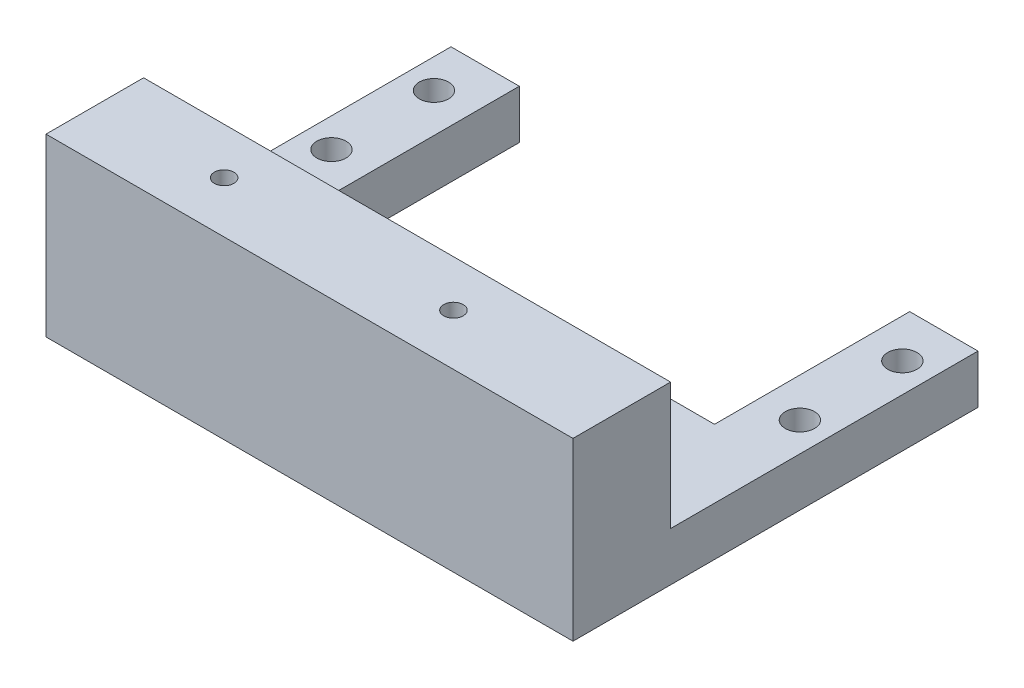
ISO-10303-21;
HEADER;
FILE_DESCRIPTION(('STEP AP214'),'2;1');
FILE_NAME('part.step','',(''),(''),'','','');
FILE_SCHEMA(('AUTOMOTIVE_DESIGN { 1 0 10303 214 1 1 1 1 }'));
ENDSEC;
DATA;
#1=APPLICATION_CONTEXT('core data for automotive mechanical design processes');
#2=APPLICATION_PROTOCOL_DEFINITION('international standard','automotive_design',2000,#1);
#3=PRODUCT_CONTEXT('',#1,'mechanical');
#4=PRODUCT('Part','Part','',(#3));
#5=PRODUCT_RELATED_PRODUCT_CATEGORY('part','',(#4));
#6=PRODUCT_DEFINITION_FORMATION('','',#4);
#7=PRODUCT_DEFINITION_CONTEXT('part definition',#1,'design');
#8=PRODUCT_DEFINITION('design','',#6,#7);
#9=PRODUCT_DEFINITION_SHAPE('','',#8);
#10=(LENGTH_UNIT() NAMED_UNIT(*) SI_UNIT(.MILLI.,.METRE.));
#11=(NAMED_UNIT(*) PLANE_ANGLE_UNIT() SI_UNIT($,.RADIAN.));
#12=(NAMED_UNIT(*) SI_UNIT($,.STERADIAN.) SOLID_ANGLE_UNIT());
#13=UNCERTAINTY_MEASURE_WITH_UNIT(LENGTH_MEASURE(1.E-05),#10,'distance_accuracy_value','');
#14=(GEOMETRIC_REPRESENTATION_CONTEXT(3) GLOBAL_UNCERTAINTY_ASSIGNED_CONTEXT((#13)) GLOBAL_UNIT_ASSIGNED_CONTEXT((#10,
#11,#12)) REPRESENTATION_CONTEXT('',''));
#15=CARTESIAN_POINT('',(0.,0.,0.));
#16=DIRECTION('',(0.,0.,1.));
#17=DIRECTION('',(1.,0.,0.));
#18=AXIS2_PLACEMENT_3D('',#15,#16,#17);
#19=CARTESIAN_POINT('',(-20.,5.,0.));
#20=DIRECTION('',(1.,0.,0.));
#21=DIRECTION('',(0.,0.,-1.));
#22=AXIS2_PLACEMENT_3D('',#19,#20,#21);
#23=PLANE('',#22);
#24=DIRECTION('',(0.,0.,1.));
#25=VECTOR('',#24,1.);
#26=CARTESIAN_POINT('',(-20.,0.,0.));
#27=LINE('',#26,#25);
#28=CARTESIAN_POINT('',(-20.,0.,-20.75));
#29=VERTEX_POINT('',#28);
#30=CARTESIAN_POINT('',(-20.,0.,-0.750000000000008));
#31=VERTEX_POINT('',#30);
#32=EDGE_CURVE('E143',#29,#31,#27,.T.);
#33=ORIENTED_EDGE('',*,*,#32,.F.);
#34=DIRECTION('',(0.,-1.,0.));
#35=VECTOR('',#34,1.);
#36=CARTESIAN_POINT('',(-20.,5.,-20.75));
#37=LINE('',#36,#35);
#38=CARTESIAN_POINT('',(-20.,5.,-20.75));
#39=VERTEX_POINT('',#38);
#40=EDGE_CURVE('E11',#39,#29,#37,.T.);
#41=ORIENTED_EDGE('',*,*,#40,.F.);
#42=DIRECTION('',(0.,0.,1.));
#43=VECTOR('',#42,1.);
#44=CARTESIAN_POINT('',(-20.,5.,0.));
#45=LINE('',#44,#43);
#46=CARTESIAN_POINT('',(-20.,5.,-0.750000000000008));
#47=VERTEX_POINT('',#46);
#48=EDGE_CURVE('E171',#39,#47,#45,.T.);
#49=ORIENTED_EDGE('',*,*,#48,.T.);
#50=DIRECTION('',(0.,-1.,0.));
#51=VECTOR('',#50,1.);
#52=CARTESIAN_POINT('',(-20.,5.,-0.750000000000008));
#53=LINE('',#52,#51);
#54=EDGE_CURVE('E64',#47,#31,#53,.T.);
#55=ORIENTED_EDGE('',*,*,#54,.T.);
#56=EDGE_LOOP('',(#33,#41,#49,#55));
#57=FACE_BOUND('',#56,.T.);
#58=ADVANCED_FACE('F40',(#57),#23,.T.);
#59=CARTESIAN_POINT('',(0.,5.,-20.75));
#60=DIRECTION('',(0.,0.,1.));
#61=DIRECTION('',(1.,0.,0.));
#62=AXIS2_PLACEMENT_3D('',#59,#60,#61);
#63=PLANE('',#62);
#64=DIRECTION('',(-1.,0.,0.));
#65=VECTOR('',#64,1.);
#66=CARTESIAN_POINT('',(0.,0.,-20.75));
#67=LINE('',#66,#65);
#68=CARTESIAN_POINT('',(-27.,0.,-20.75));
#69=VERTEX_POINT('',#68);
#70=EDGE_CURVE('E146',#29,#69,#67,.T.);
#71=ORIENTED_EDGE('',*,*,#70,.T.);
#72=DIRECTION('',(0.,-1.,0.));
#73=VECTOR('',#72,1.);
#74=CARTESIAN_POINT('',(-27.,5.,-20.75));
#75=LINE('',#74,#73);
#76=CARTESIAN_POINT('',(-27.,5.,-20.75));
#77=VERTEX_POINT('',#76);
#78=EDGE_CURVE('E48',#77,#69,#75,.T.);
#79=ORIENTED_EDGE('',*,*,#78,.F.);
#80=DIRECTION('',(-1.,0.,0.));
#81=VECTOR('',#80,1.);
#82=CARTESIAN_POINT('',(0.,5.,-20.75));
#83=LINE('',#82,#81);
#84=EDGE_CURVE('E270',#39,#77,#83,.T.);
#85=ORIENTED_EDGE('',*,*,#84,.F.);
#86=ORIENTED_EDGE('',*,*,#40,.T.);
#87=EDGE_LOOP('',(#71,#79,#85,#86));
#88=FACE_BOUND('',#87,.T.);
#89=ADVANCED_FACE('F194',(#88),#63,.F.);
#90=CARTESIAN_POINT('',(-27.,5.,0.));
#91=DIRECTION('',(-1.,0.,0.));
#92=DIRECTION('',(0.,0.,1.));
#93=AXIS2_PLACEMENT_3D('',#90,#91,#92);
#94=PLANE('',#93);
#95=DIRECTION('',(0.,0.,-1.));
#96=VECTOR('',#95,1.);
#97=CARTESIAN_POINT('',(-27.,0.,0.));
#98=LINE('',#97,#96);
#99=CARTESIAN_POINT('',(-27.,0.,20.75));
#100=VERTEX_POINT('',#99);
#101=EDGE_CURVE('E151',#100,#69,#98,.T.);
#102=ORIENTED_EDGE('',*,*,#101,.F.);
#103=DIRECTION('',(0.,-1.,0.));
#104=VECTOR('',#103,1.);
#105=CARTESIAN_POINT('',(-27.,5.,20.75));
#106=LINE('',#105,#104);
#107=CARTESIAN_POINT('',(-27.,18.,20.75));
#108=VERTEX_POINT('',#107);
#109=EDGE_CURVE('E181',#108,#100,#106,.T.);
#110=ORIENTED_EDGE('',*,*,#109,.F.);
#111=DIRECTION('',(0.,0.,1.));
#112=VECTOR('',#111,1.);
#113=CARTESIAN_POINT('',(-27.,18.,20.75));
#114=LINE('',#113,#112);
#115=CARTESIAN_POINT('',(-27.,18.,10.75));
#116=VERTEX_POINT('',#115);
#117=EDGE_CURVE('E209',#116,#108,#114,.T.);
#118=ORIENTED_EDGE('',*,*,#117,.F.);
#119=DIRECTION('',(0.,-1.,0.));
#120=VECTOR('',#119,1.);
#121=CARTESIAN_POINT('',(-27.,18.,10.75));
#122=LINE('',#121,#120);
#123=CARTESIAN_POINT('',(-27.,5.,10.75));
#124=VERTEX_POINT('',#123);
#125=EDGE_CURVE('E227',#116,#124,#122,.T.);
#126=ORIENTED_EDGE('',*,*,#125,.T.);
#127=DIRECTION('',(0.,0.,-1.));
#128=VECTOR('',#127,1.);
#129=CARTESIAN_POINT('',(-27.,5.,0.));
#130=LINE('',#129,#128);
#131=EDGE_CURVE('E190',#124,#77,#130,.T.);
#132=ORIENTED_EDGE('',*,*,#131,.T.);
#133=ORIENTED_EDGE('',*,*,#78,.T.);
#134=EDGE_LOOP('',(#102,#110,#118,#126,#132,#133));
#135=FACE_BOUND('',#134,.T.);
#136=ADVANCED_FACE('F187',(#135),#94,.T.);
#137=CARTESIAN_POINT('',(0.,5.,20.75));
#138=DIRECTION('',(0.,0.,1.));
#139=DIRECTION('',(1.,0.,0.));
#140=AXIS2_PLACEMENT_3D('',#137,#138,#139);
#141=PLANE('',#140);
#142=DIRECTION('',(-1.,0.,0.));
#143=VECTOR('',#142,1.);
#144=CARTESIAN_POINT('',(0.,0.,20.75));
#145=LINE('',#144,#143);
#146=CARTESIAN_POINT('',(27.,0.,20.75));
#147=VERTEX_POINT('',#146);
#148=EDGE_CURVE('E155',#147,#100,#145,.T.);
#149=ORIENTED_EDGE('',*,*,#148,.F.);
#150=DIRECTION('',(0.,-1.,0.));
#151=VECTOR('',#150,1.);
#152=CARTESIAN_POINT('',(27.,5.,20.75));
#153=LINE('',#152,#151);
#154=CARTESIAN_POINT('',(27.,18.,20.75));
#155=VERTEX_POINT('',#154);
#156=EDGE_CURVE('E178',#155,#147,#153,.T.);
#157=ORIENTED_EDGE('',*,*,#156,.F.);
#158=DIRECTION('',(1.,0.,0.));
#159=VECTOR('',#158,1.);
#160=CARTESIAN_POINT('',(-27.,18.,20.75));
#161=LINE('',#160,#159);
#162=EDGE_CURVE('E206',#108,#155,#161,.T.);
#163=ORIENTED_EDGE('',*,*,#162,.F.);
#164=ORIENTED_EDGE('',*,*,#109,.T.);
#165=EDGE_LOOP('',(#149,#157,#163,#164));
#166=FACE_BOUND('',#165,.T.);
#167=ADVANCED_FACE('F201',(#166),#141,.T.);
#168=CARTESIAN_POINT('',(27.,5.,0.));
#169=DIRECTION('',(-1.,0.,0.));
#170=DIRECTION('',(0.,0.,1.));
#171=AXIS2_PLACEMENT_3D('',#168,#169,#170);
#172=PLANE('',#171);
#173=DIRECTION('',(0.,0.,-1.));
#174=VECTOR('',#173,1.);
#175=CARTESIAN_POINT('',(27.,0.,0.));
#176=LINE('',#175,#174);
#177=CARTESIAN_POINT('',(27.,0.,-20.75));
#178=VERTEX_POINT('',#177);
#179=EDGE_CURVE('E159',#147,#178,#176,.T.);
#180=ORIENTED_EDGE('',*,*,#179,.T.);
#181=DIRECTION('',(0.,-1.,0.));
#182=VECTOR('',#181,1.);
#183=CARTESIAN_POINT('',(27.,5.,-20.75));
#184=LINE('',#183,#182);
#185=CARTESIAN_POINT('',(27.,5.,-20.75));
#186=VERTEX_POINT('',#185);
#187=EDGE_CURVE('E132',#186,#178,#184,.T.);
#188=ORIENTED_EDGE('',*,*,#187,.F.);
#189=DIRECTION('',(0.,0.,-1.));
#190=VECTOR('',#189,1.);
#191=CARTESIAN_POINT('',(27.,5.,0.));
#192=LINE('',#191,#190);
#193=CARTESIAN_POINT('',(27.,5.,10.75));
#194=VERTEX_POINT('',#193);
#195=EDGE_CURVE('E117',#194,#186,#192,.T.);
#196=ORIENTED_EDGE('',*,*,#195,.F.);
#197=DIRECTION('',(0.,-1.,0.));
#198=VECTOR('',#197,1.);
#199=CARTESIAN_POINT('',(27.,18.,10.75));
#200=LINE('',#199,#198);
#201=CARTESIAN_POINT('',(27.,18.,10.75));
#202=VERTEX_POINT('',#201);
#203=EDGE_CURVE('E231',#202,#194,#200,.T.);
#204=ORIENTED_EDGE('',*,*,#203,.F.);
#205=DIRECTION('',(0.,0.,-1.));
#206=VECTOR('',#205,1.);
#207=CARTESIAN_POINT('',(27.,18.,20.75));
#208=LINE('',#207,#206);
#209=EDGE_CURVE('E222',#155,#202,#208,.T.);
#210=ORIENTED_EDGE('',*,*,#209,.F.);
#211=ORIENTED_EDGE('',*,*,#156,.T.);
#212=EDGE_LOOP('',(#180,#188,#196,#204,#210,#211));
#213=FACE_BOUND('',#212,.T.);
#214=ADVANCED_FACE('F287',(#213),#172,.F.);
#215=CARTESIAN_POINT('',(0.,5.,-20.75));
#216=DIRECTION('',(0.,0.,1.));
#217=DIRECTION('',(1.,0.,0.));
#218=AXIS2_PLACEMENT_3D('',#215,#216,#217);
#219=PLANE('',#218);
#220=DIRECTION('',(-1.,0.,0.));
#221=VECTOR('',#220,1.);
#222=CARTESIAN_POINT('',(0.,0.,-20.75));
#223=LINE('',#222,#221);
#224=CARTESIAN_POINT('',(20.,0.,-20.75));
#225=VERTEX_POINT('',#224);
#226=EDGE_CURVE('E127',#178,#225,#223,.T.);
#227=ORIENTED_EDGE('',*,*,#226,.T.);
#228=DIRECTION('',(0.,-1.,0.));
#229=VECTOR('',#228,1.);
#230=CARTESIAN_POINT('',(20.,5.,-20.75));
#231=LINE('',#230,#229);
#232=CARTESIAN_POINT('',(20.,5.,-20.75));
#233=VERTEX_POINT('',#232);
#234=EDGE_CURVE('E124',#233,#225,#231,.T.);
#235=ORIENTED_EDGE('',*,*,#234,.F.);
#236=DIRECTION('',(-1.,0.,0.));
#237=VECTOR('',#236,1.);
#238=CARTESIAN_POINT('',(0.,5.,-20.75));
#239=LINE('',#238,#237);
#240=EDGE_CURVE('E110',#186,#233,#239,.T.);
#241=ORIENTED_EDGE('',*,*,#240,.F.);
#242=ORIENTED_EDGE('',*,*,#187,.T.);
#243=EDGE_LOOP('',(#227,#235,#241,#242));
#244=FACE_BOUND('',#243,.T.);
#245=ADVANCED_FACE('F125',(#244),#219,.F.);
#246=CARTESIAN_POINT('',(20.,5.,0.));
#247=DIRECTION('',(-1.,0.,0.));
#248=DIRECTION('',(0.,0.,1.));
#249=AXIS2_PLACEMENT_3D('',#246,#247,#248);
#250=PLANE('',#249);
#251=DIRECTION('',(0.,0.,-1.));
#252=VECTOR('',#251,1.);
#253=CARTESIAN_POINT('',(20.,0.,0.));
#254=LINE('',#253,#252);
#255=CARTESIAN_POINT('',(20.,0.,-0.750000000000008));
#256=VERTEX_POINT('',#255);
#257=EDGE_CURVE('E164',#256,#225,#254,.T.);
#258=ORIENTED_EDGE('',*,*,#257,.F.);
#259=DIRECTION('',(0.,-1.,0.));
#260=VECTOR('',#259,1.);
#261=CARTESIAN_POINT('',(20.,5.,-0.750000000000008));
#262=LINE('',#261,#260);
#263=CARTESIAN_POINT('',(20.,5.,-0.750000000000008));
#264=VERTEX_POINT('',#263);
#265=EDGE_CURVE('E133',#264,#256,#262,.T.);
#266=ORIENTED_EDGE('',*,*,#265,.F.);
#267=DIRECTION('',(0.,0.,-1.));
#268=VECTOR('',#267,1.);
#269=CARTESIAN_POINT('',(20.,5.,0.));
#270=LINE('',#269,#268);
#271=EDGE_CURVE('E116',#264,#233,#270,.T.);
#272=ORIENTED_EDGE('',*,*,#271,.T.);
#273=ORIENTED_EDGE('',*,*,#234,.T.);
#274=EDGE_LOOP('',(#258,#266,#272,#273));
#275=FACE_BOUND('',#274,.T.);
#276=ADVANCED_FACE('F135',(#275),#250,.T.);
#277=CARTESIAN_POINT('',(0.,5.,-0.750000000000008));
#278=DIRECTION('',(0.,0.,-1.));
#279=DIRECTION('',(-1.,0.,0.));
#280=AXIS2_PLACEMENT_3D('',#277,#278,#279);
#281=PLANE('',#280);
#282=DIRECTION('',(1.,0.,0.));
#283=VECTOR('',#282,1.);
#284=CARTESIAN_POINT('',(0.,0.,-0.750000000000008));
#285=LINE('',#284,#283);
#286=EDGE_CURVE('E167',#31,#256,#285,.T.);
#287=ORIENTED_EDGE('',*,*,#286,.F.);
#288=ORIENTED_EDGE('',*,*,#54,.F.);
#289=DIRECTION('',(1.,0.,0.));
#290=VECTOR('',#289,1.);
#291=CARTESIAN_POINT('',(0.,5.,-0.750000000000008));
#292=LINE('',#291,#290);
#293=EDGE_CURVE('E137',#47,#264,#292,.T.);
#294=ORIENTED_EDGE('',*,*,#293,.T.);
#295=ORIENTED_EDGE('',*,*,#265,.T.);
#296=EDGE_LOOP('',(#287,#288,#294,#295));
#297=FACE_BOUND('',#296,.T.);
#298=ADVANCED_FACE('F295',(#297),#281,.T.);
#299=CARTESIAN_POINT('',(0.,5.,0.));
#300=DIRECTION('',(0.,1.,0.));
#301=DIRECTION('',(0.,0.,1.));
#302=AXIS2_PLACEMENT_3D('',#299,#300,#301);
#303=PLANE('',#302);
#304=DIRECTION('',(-1.,0.,0.));
#305=VECTOR('',#304,1.);
#306=CARTESIAN_POINT('',(-27.,5.,10.75));
#307=LINE('',#306,#305);
#308=EDGE_CURVE('E55',#194,#124,#307,.T.);
#309=ORIENTED_EDGE('',*,*,#308,.F.);
#310=ORIENTED_EDGE('',*,*,#195,.T.);
#311=ORIENTED_EDGE('',*,*,#240,.T.);
#312=ORIENTED_EDGE('',*,*,#271,.F.);
#313=ORIENTED_EDGE('',*,*,#293,.F.);
#314=ORIENTED_EDGE('',*,*,#48,.F.);
#315=ORIENTED_EDGE('',*,*,#84,.T.);
#316=ORIENTED_EDGE('',*,*,#131,.F.);
#317=EDGE_LOOP('',(#309,#310,#311,#312,#313,#314,#315,#316));
#318=FACE_BOUND('',#317,.T.);
#319=CARTESIAN_POINT('',(-24.,5.,-5.5));
#320=DIRECTION('',(0.,1.,0.));
#321=DIRECTION('',(0.,0.,1.));
#322=AXIS2_PLACEMENT_3D('',#319,#320,#321);
#323=CIRCLE('',#322,1.5);
#324=CARTESIAN_POINT('',(-24.,5.,-4.));
#325=VERTEX_POINT('',#324);
#326=EDGE_CURVE('E251',#325,#325,#323,.T.);
#327=ORIENTED_EDGE('',*,*,#326,.F.);
#328=EDGE_LOOP('',(#327));
#329=FACE_BOUND('',#328,.T.);
#330=CARTESIAN_POINT('',(24.,5.,-16.));
#331=DIRECTION('',(0.,1.,0.));
#332=DIRECTION('',(0.,0.,1.));
#333=AXIS2_PLACEMENT_3D('',#330,#331,#332);
#334=CIRCLE('',#333,1.5);
#335=CARTESIAN_POINT('',(24.,5.,-14.5));
#336=VERTEX_POINT('',#335);
#337=EDGE_CURVE('E242',#336,#336,#334,.T.);
#338=ORIENTED_EDGE('',*,*,#337,.F.);
#339=EDGE_LOOP('',(#338));
#340=FACE_BOUND('',#339,.T.);
#341=CARTESIAN_POINT('',(24.,5.,-5.50000000000001));
#342=DIRECTION('',(0.,1.,0.));
#343=DIRECTION('',(0.,0.,1.));
#344=AXIS2_PLACEMENT_3D('',#341,#342,#343);
#345=CIRCLE('',#344,1.5);
#346=CARTESIAN_POINT('',(24.,5.,-4.00000000000001));
#347=VERTEX_POINT('',#346);
#348=EDGE_CURVE('E234',#347,#347,#345,.T.);
#349=ORIENTED_EDGE('',*,*,#348,.F.);
#350=EDGE_LOOP('',(#349));
#351=FACE_BOUND('',#350,.T.);
#352=CARTESIAN_POINT('',(-24.,5.,-16.));
#353=DIRECTION('',(0.,1.,0.));
#354=DIRECTION('',(0.,0.,1.));
#355=AXIS2_PLACEMENT_3D('',#352,#353,#354);
#356=CIRCLE('',#355,1.5);
#357=CARTESIAN_POINT('',(-24.,5.,-14.5));
#358=VERTEX_POINT('',#357);
#359=EDGE_CURVE('E250',#358,#358,#356,.T.);
#360=ORIENTED_EDGE('',*,*,#359,.F.);
#361=EDGE_LOOP('',(#360));
#362=FACE_BOUND('',#361,.T.);
#363=ADVANCED_FACE('F112',(#318,#329,#340,#351,#362),#303,.T.);
#364=CARTESIAN_POINT('',(0.,0.,0.));
#365=DIRECTION('',(0.,1.,0.));
#366=DIRECTION('',(0.,0.,1.));
#367=AXIS2_PLACEMENT_3D('',#364,#365,#366);
#368=PLANE('',#367);
#369=CARTESIAN_POINT('',(-24.,0.,-5.5));
#370=DIRECTION('',(0.,1.,0.));
#371=DIRECTION('',(0.,0.,1.));
#372=AXIS2_PLACEMENT_3D('',#369,#370,#371);
#373=CIRCLE('',#372,1.5);
#374=CARTESIAN_POINT('',(-24.,0.,-4.));
#375=VERTEX_POINT('',#374);
#376=EDGE_CURVE('E246',#375,#375,#373,.T.);
#377=ORIENTED_EDGE('',*,*,#376,.T.);
#378=EDGE_LOOP('',(#377));
#379=FACE_BOUND('',#378,.T.);
#380=CARTESIAN_POINT('',(24.,0.,-16.));
#381=DIRECTION('',(0.,1.,0.));
#382=DIRECTION('',(0.,0.,1.));
#383=AXIS2_PLACEMENT_3D('',#380,#381,#382);
#384=CIRCLE('',#383,1.5);
#385=CARTESIAN_POINT('',(24.,0.,-14.5));
#386=VERTEX_POINT('',#385);
#387=EDGE_CURVE('E255',#386,#386,#384,.T.);
#388=ORIENTED_EDGE('',*,*,#387,.T.);
#389=EDGE_LOOP('',(#388));
#390=FACE_BOUND('',#389,.T.);
#391=CARTESIAN_POINT('',(24.,0.,-5.50000000000001));
#392=DIRECTION('',(0.,1.,0.));
#393=DIRECTION('',(0.,0.,1.));
#394=AXIS2_PLACEMENT_3D('',#391,#392,#393);
#395=CIRCLE('',#394,1.5);
#396=CARTESIAN_POINT('',(24.,0.,-4.00000000000001));
#397=VERTEX_POINT('',#396);
#398=EDGE_CURVE('E238',#397,#397,#395,.T.);
#399=ORIENTED_EDGE('',*,*,#398,.T.);
#400=EDGE_LOOP('',(#399));
#401=FACE_BOUND('',#400,.T.);
#402=CARTESIAN_POINT('',(-24.,0.,-16.));
#403=DIRECTION('',(0.,1.,0.));
#404=DIRECTION('',(0.,0.,1.));
#405=AXIS2_PLACEMENT_3D('',#402,#403,#404);
#406=CIRCLE('',#405,1.5);
#407=CARTESIAN_POINT('',(-24.,0.,-14.5));
#408=VERTEX_POINT('',#407);
#409=EDGE_CURVE('E147',#408,#408,#406,.T.);
#410=ORIENTED_EDGE('',*,*,#409,.T.);
#411=EDGE_LOOP('',(#410));
#412=FACE_BOUND('',#411,.T.);
#413=ORIENTED_EDGE('',*,*,#32,.T.);
#414=ORIENTED_EDGE('',*,*,#286,.T.);
#415=ORIENTED_EDGE('',*,*,#257,.T.);
#416=ORIENTED_EDGE('',*,*,#226,.F.);
#417=ORIENTED_EDGE('',*,*,#179,.F.);
#418=ORIENTED_EDGE('',*,*,#148,.T.);
#419=ORIENTED_EDGE('',*,*,#101,.T.);
#420=ORIENTED_EDGE('',*,*,#70,.F.);
#421=EDGE_LOOP('',(#413,#414,#415,#416,#417,#418,#419,#420));
#422=FACE_BOUND('',#421,.T.);
#423=ADVANCED_FACE('F196',(#379,#390,#401,#412,#422),#368,.F.);
#424=CARTESIAN_POINT('',(-24.,0.,-16.));
#425=DIRECTION('',(0.,1.,0.));
#426=DIRECTION('',(0.,0.,1.));
#427=AXIS2_PLACEMENT_3D('',#424,#425,#426);
#428=CYLINDRICAL_SURFACE('',#427,1.5);
#429=ORIENTED_EDGE('',*,*,#409,.F.);
#430=EDGE_LOOP('',(#429));
#431=FACE_BOUND('',#430,.T.);
#432=ORIENTED_EDGE('',*,*,#359,.T.);
#433=EDGE_LOOP('',(#432));
#434=FACE_BOUND('',#433,.T.);
#435=ADVANCED_FACE('F300',(#431,#434),#428,.F.);
#436=CARTESIAN_POINT('',(24.,0.,-5.50000000000001));
#437=DIRECTION('',(0.,1.,0.));
#438=DIRECTION('',(0.,0.,1.));
#439=AXIS2_PLACEMENT_3D('',#436,#437,#438);
#440=CYLINDRICAL_SURFACE('',#439,1.5);
#441=ORIENTED_EDGE('',*,*,#398,.F.);
#442=EDGE_LOOP('',(#441));
#443=FACE_BOUND('',#442,.T.);
#444=ORIENTED_EDGE('',*,*,#348,.T.);
#445=EDGE_LOOP('',(#444));
#446=FACE_BOUND('',#445,.T.);
#447=ADVANCED_FACE('F306',(#443,#446),#440,.F.);
#448=CARTESIAN_POINT('',(24.,0.,-16.));
#449=DIRECTION('',(0.,1.,0.));
#450=DIRECTION('',(0.,0.,1.));
#451=AXIS2_PLACEMENT_3D('',#448,#449,#450);
#452=CYLINDRICAL_SURFACE('',#451,1.5);
#453=ORIENTED_EDGE('',*,*,#387,.F.);
#454=EDGE_LOOP('',(#453));
#455=FACE_BOUND('',#454,.T.);
#456=ORIENTED_EDGE('',*,*,#337,.T.);
#457=EDGE_LOOP('',(#456));
#458=FACE_BOUND('',#457,.T.);
#459=ADVANCED_FACE('F308',(#455,#458),#452,.F.);
#460=CARTESIAN_POINT('',(-24.,0.,-5.5));
#461=DIRECTION('',(0.,1.,0.));
#462=DIRECTION('',(0.,0.,1.));
#463=AXIS2_PLACEMENT_3D('',#460,#461,#462);
#464=CYLINDRICAL_SURFACE('',#463,1.5);
#465=ORIENTED_EDGE('',*,*,#376,.F.);
#466=EDGE_LOOP('',(#465));
#467=FACE_BOUND('',#466,.T.);
#468=ORIENTED_EDGE('',*,*,#326,.T.);
#469=EDGE_LOOP('',(#468));
#470=FACE_BOUND('',#469,.T.);
#471=ADVANCED_FACE('F311',(#467,#470),#464,.F.);
#472=CARTESIAN_POINT('',(-27.,18.,10.75));
#473=DIRECTION('',(0.,0.,1.));
#474=DIRECTION('',(1.,0.,0.));
#475=AXIS2_PLACEMENT_3D('',#472,#473,#474);
#476=PLANE('',#475);
#477=ORIENTED_EDGE('',*,*,#308,.T.);
#478=ORIENTED_EDGE('',*,*,#125,.F.);
#479=DIRECTION('',(-1.,0.,0.));
#480=VECTOR('',#479,1.);
#481=CARTESIAN_POINT('',(-27.,18.,10.75));
#482=LINE('',#481,#480);
#483=EDGE_CURVE('E218',#202,#116,#482,.T.);
#484=ORIENTED_EDGE('',*,*,#483,.F.);
#485=ORIENTED_EDGE('',*,*,#203,.T.);
#486=EDGE_LOOP('',(#477,#478,#484,#485));
#487=FACE_BOUND('',#486,.T.);
#488=ADVANCED_FACE('F229',(#487),#476,.F.);
#489=CARTESIAN_POINT('',(0.,18.,0.));
#490=DIRECTION('',(0.,-1.,0.));
#491=DIRECTION('',(0.,0.,-1.));
#492=AXIS2_PLACEMENT_3D('',#489,#490,#491);
#493=PLANE('',#492);
#494=CARTESIAN_POINT('',(-14.,18.,15.5));
#495=DIRECTION('',(0.,1.,0.));
#496=DIRECTION('',(0.,0.,1.));
#497=AXIS2_PLACEMENT_3D('',#494,#495,#496);
#498=CIRCLE('',#497,1.);
#499=CARTESIAN_POINT('',(-14.,18.,16.5));
#500=VERTEX_POINT('',#499);
#501=EDGE_CURVE('E345',#500,#500,#498,.T.);
#502=ORIENTED_EDGE('',*,*,#501,.F.);
#503=EDGE_LOOP('',(#502));
#504=FACE_BOUND('',#503,.T.);
#505=CARTESIAN_POINT('',(9.5,18.,15.5));
#506=DIRECTION('',(0.,1.,0.));
#507=DIRECTION('',(0.,0.,1.));
#508=AXIS2_PLACEMENT_3D('',#505,#506,#507);
#509=CIRCLE('',#508,1.);
#510=CARTESIAN_POINT('',(9.5,18.,16.5));
#511=VERTEX_POINT('',#510);
#512=EDGE_CURVE('E356',#511,#511,#509,.T.);
#513=ORIENTED_EDGE('',*,*,#512,.F.);
#514=EDGE_LOOP('',(#513));
#515=FACE_BOUND('',#514,.T.);
#516=ORIENTED_EDGE('',*,*,#117,.T.);
#517=ORIENTED_EDGE('',*,*,#162,.T.);
#518=ORIENTED_EDGE('',*,*,#209,.T.);
#519=ORIENTED_EDGE('',*,*,#483,.T.);
#520=EDGE_LOOP('',(#516,#517,#518,#519));
#521=FACE_BOUND('',#520,.T.);
#522=ADVANCED_FACE('F220',(#504,#515,#521),#493,.F.);
#523=CARTESIAN_POINT('',(9.5,12.,15.5));
#524=DIRECTION('',(0.,1.,0.));
#525=DIRECTION('',(0.,0.,1.));
#526=AXIS2_PLACEMENT_3D('',#523,#524,#525);
#527=CYLINDRICAL_SURFACE('',#526,1.);
#528=CARTESIAN_POINT('',(9.5,12.,15.5));
#529=DIRECTION('',(0.,1.,0.));
#530=DIRECTION('',(0.,0.,1.));
#531=AXIS2_PLACEMENT_3D('',#528,#529,#530);
#532=CIRCLE('',#531,1.);
#533=CARTESIAN_POINT('',(9.5,12.,16.5));
#534=VERTEX_POINT('',#533);
#535=EDGE_CURVE('E350',#534,#534,#532,.T.);
#536=ORIENTED_EDGE('',*,*,#535,.F.);
#537=EDGE_LOOP('',(#536));
#538=FACE_BOUND('',#537,.T.);
#539=ORIENTED_EDGE('',*,*,#512,.T.);
#540=EDGE_LOOP('',(#539));
#541=FACE_BOUND('',#540,.T.);
#542=ADVANCED_FACE('F323',(#538,#541),#527,.F.);
#543=CARTESIAN_POINT('',(9.5,12.,15.5));
#544=DIRECTION('',(0.,1.,0.));
#545=DIRECTION('',(0.,0.,1.));
#546=AXIS2_PLACEMENT_3D('',#543,#544,#545);
#547=PLANE('',#546);
#548=ORIENTED_EDGE('',*,*,#535,.T.);
#549=EDGE_LOOP('',(#548));
#550=FACE_BOUND('',#549,.T.);
#551=ADVANCED_FACE('F327',(#550),#547,.T.);
#552=CARTESIAN_POINT('',(-14.,12.,15.5));
#553=DIRECTION('',(0.,1.,0.));
#554=DIRECTION('',(0.,0.,1.));
#555=AXIS2_PLACEMENT_3D('',#552,#553,#554);
#556=CYLINDRICAL_SURFACE('',#555,1.);
#557=CARTESIAN_POINT('',(-14.,12.,15.5));
#558=DIRECTION('',(0.,1.,0.));
#559=DIRECTION('',(0.,0.,1.));
#560=AXIS2_PLACEMENT_3D('',#557,#558,#559);
#561=CIRCLE('',#560,1.);
#562=CARTESIAN_POINT('',(-14.,12.,16.5));
#563=VERTEX_POINT('',#562);
#564=EDGE_CURVE('E343',#563,#563,#561,.T.);
#565=ORIENTED_EDGE('',*,*,#564,.F.);
#566=EDGE_LOOP('',(#565));
#567=FACE_BOUND('',#566,.T.);
#568=ORIENTED_EDGE('',*,*,#501,.T.);
#569=EDGE_LOOP('',(#568));
#570=FACE_BOUND('',#569,.T.);
#571=ADVANCED_FACE('F331',(#567,#570),#556,.F.);
#572=CARTESIAN_POINT('',(-14.,12.,15.5));
#573=DIRECTION('',(0.,1.,0.));
#574=DIRECTION('',(0.,0.,1.));
#575=AXIS2_PLACEMENT_3D('',#572,#573,#574);
#576=PLANE('',#575);
#577=ORIENTED_EDGE('',*,*,#564,.T.);
#578=EDGE_LOOP('',(#577));
#579=FACE_BOUND('',#578,.T.);
#580=ADVANCED_FACE('F335',(#579),#576,.T.);
#581=CLOSED_SHELL('',(#58,#89,#136,#167,#214,#245,#276,#298,#363,#423,#435,#447,#459,#471,#488,
#522,#542,#551,#571,#580));
#582=MANIFOLD_SOLID_BREP('B2',#581);
#583=ADVANCED_BREP_SHAPE_REPRESENTATION('',(#18,#582),#14);
#584=SHAPE_DEFINITION_REPRESENTATION(#9,#583);
ENDSEC;
END-ISO-10303-21;
